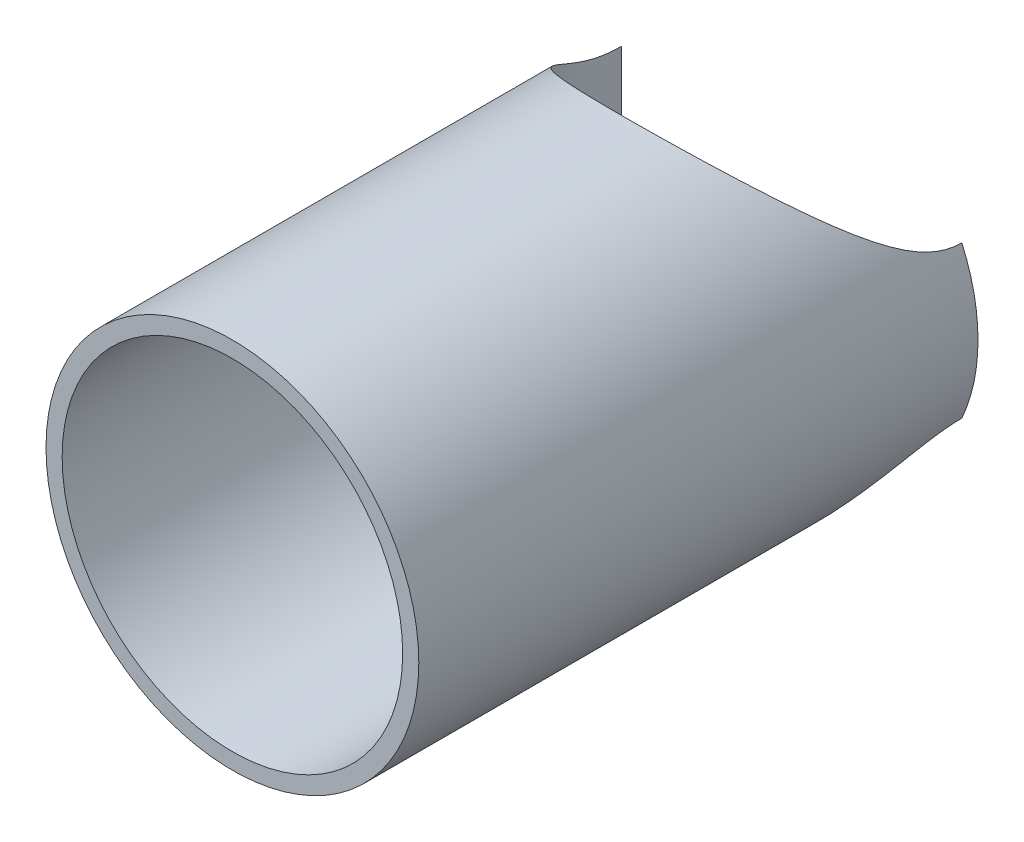
ISO-10303-21;
HEADER;
FILE_DESCRIPTION(('STEP AP214'),'2;1');
FILE_NAME('part.step','',(''),(''),'','','');
FILE_SCHEMA(('AUTOMOTIVE_DESIGN { 1 0 10303 214 1 1 1 1 }'));
ENDSEC;
DATA;
#1=APPLICATION_CONTEXT('core data for automotive mechanical design processes');
#2=APPLICATION_PROTOCOL_DEFINITION('international standard','automotive_design',2000,#1);
#3=PRODUCT_CONTEXT('',#1,'mechanical');
#4=PRODUCT('Part','Part','',(#3));
#5=PRODUCT_RELATED_PRODUCT_CATEGORY('part','',(#4));
#6=PRODUCT_DEFINITION_FORMATION('','',#4);
#7=PRODUCT_DEFINITION_CONTEXT('part definition',#1,'design');
#8=PRODUCT_DEFINITION('design','',#6,#7);
#9=PRODUCT_DEFINITION_SHAPE('','',#8);
#10=(LENGTH_UNIT() NAMED_UNIT(*) SI_UNIT(.MILLI.,.METRE.));
#11=(NAMED_UNIT(*) PLANE_ANGLE_UNIT() SI_UNIT($,.RADIAN.));
#12=(NAMED_UNIT(*) SI_UNIT($,.STERADIAN.) SOLID_ANGLE_UNIT());
#13=UNCERTAINTY_MEASURE_WITH_UNIT(LENGTH_MEASURE(1.E-05),#10,'distance_accuracy_value','');
#14=(GEOMETRIC_REPRESENTATION_CONTEXT(3) GLOBAL_UNCERTAINTY_ASSIGNED_CONTEXT((#13)) GLOBAL_UNIT_ASSIGNED_CONTEXT((#10,
#11,#12)) REPRESENTATION_CONTEXT('',''));
#15=CARTESIAN_POINT('',(0.,0.,0.));
#16=DIRECTION('',(0.,0.,1.));
#17=DIRECTION('',(1.,0.,0.));
#18=AXIS2_PLACEMENT_3D('',#15,#16,#17);
#19=CARTESIAN_POINT('',(0.,0.,0.));
#20=DIRECTION('',(0.,0.,1.));
#21=DIRECTION('',(1.,0.,0.));
#22=AXIS2_PLACEMENT_3D('',#19,#20,#21);
#23=CYLINDRICAL_SURFACE('',#22,17.399);
#24=CARTESIAN_POINT('',(0.,0.,57.15));
#25=DIRECTION('',(0.,0.,1.));
#26=DIRECTION('',(1.,0.,0.));
#27=AXIS2_PLACEMENT_3D('',#24,#25,#26);
#28=CIRCLE('',#27,17.399);
#29=CARTESIAN_POINT('',(17.399,0.,57.15));
#30=VERTEX_POINT('',#29);
#31=EDGE_CURVE('E63',#30,#30,#28,.T.);
#32=ORIENTED_EDGE('',*,*,#31,.T.);
#33=EDGE_LOOP('',(#32));
#34=FACE_BOUND('',#33,.T.);
#35=CARTESIAN_POINT('',(0.,0.,0.));
#36=DIRECTION('',(0.,0.707106781186547,0.707106781186547));
#37=DIRECTION('',(0.,-0.707106781186547,0.707106781186547));
#38=AXIS2_PLACEMENT_3D('',#35,#36,#37);
#39=ELLIPSE('',#38,24.6059017717295,17.399);
#40=CARTESIAN_POINT('',(17.399,0.,0.));
#41=VERTEX_POINT('',#40);
#42=CARTESIAN_POINT('',(-17.399,0.,0.));
#43=VERTEX_POINT('',#42);
#44=EDGE_CURVE('E66',#41,#43,#39,.F.);
#45=ORIENTED_EDGE('',*,*,#44,.T.);
#46=CARTESIAN_POINT('',(-17.399,0.,0.));
#47=CARTESIAN_POINT('',(-17.3990011308637,0.331328994913658,0.331288499369272));
#48=CARTESIAN_POINT('',(-17.3895359806133,0.662777773993524,0.662452537391861));
#49=CARTESIAN_POINT('',(-17.3541828902262,1.28061881246956,1.27984220901783));
#50=CARTESIAN_POINT('',(-17.3306707170862,1.56708522254114,1.56613126731348));
#51=CARTESIAN_POINT('',(-17.2741593932983,2.09467960281504,2.09380128423432));
#52=CARTESIAN_POINT('',(-17.2431973119173,2.33594824844743,2.33526043823023));
#53=CARTESIAN_POINT('',(-17.1776790099059,2.77346193365283,2.77318291899473));
#54=CARTESIAN_POINT('',(-17.1448260231368,2.96984141024758,2.96976916303656));
#55=CARTESIAN_POINT('',(-17.053195396441,3.46498957987095,3.46509972389225));
#56=CARTESIAN_POINT('',(-16.98985851291,3.76343285860517,3.76334049026127));
#57=CARTESIAN_POINT('',(-16.8511806994521,4.34120611378342,4.34086899698307));
#58=CARTESIAN_POINT('',(-16.7767389829828,4.62064871339775,4.62026081720835));
#59=CARTESIAN_POINT('',(-16.618357658026,5.16038592403,5.16002415026488));
#60=CARTESIAN_POINT('',(-16.5352733410015,5.42080962241243,5.42051715790507));
#61=CARTESIAN_POINT('',(-16.3619682824427,5.9225854699662,5.92246621840775));
#62=CARTESIAN_POINT('',(-16.2725596410971,6.16407928160144,6.16406139907093));
#63=CARTESIAN_POINT('',(-16.0648641936773,6.68870400423923,6.68872514664784));
#64=CARTESIAN_POINT('',(-15.9442842191765,6.97140000285117,6.97132558864669));
#65=CARTESIAN_POINT('',(-15.692090264551,7.52138357655295,7.52117234296158));
#66=CARTESIAN_POINT('',(-15.5611400425067,7.7888244237628,7.78856984279287));
#67=CARTESIAN_POINT('',(-15.2898825899193,8.30823658158246,8.30799045094507));
#68=CARTESIAN_POINT('',(-15.1502208515848,8.56037821331848,8.56017986480889));
#69=CARTESIAN_POINT('',(-14.8631475667476,9.04924098266211,9.04916207079481));
#70=CARTESIAN_POINT('',(-14.716363574788,9.28614688008941,9.28613845727461));
#71=CARTESIAN_POINT('',(-14.3951906833458,9.77740171343267,9.77741091638758));
#72=CARTESIAN_POINT('',(-14.2195041976432,10.0313338750929,10.0312781848761));
#73=CARTESIAN_POINT('',(-13.8583245878214,10.524357664459,10.5242054716175));
#74=CARTESIAN_POINT('',(-13.6733966582859,10.7636567269108,10.7634718304358));
#75=CARTESIAN_POINT('',(-13.2950314709039,11.2273598541476,11.2271796122021));
#76=CARTESIAN_POINT('',(-13.1021449124595,11.4519894946947,11.4518441165275));
#77=CARTESIAN_POINT('',(-12.7091177143155,11.8863833716026,11.8863260772742));
#78=CARTESIAN_POINT('',(-12.5095124093792,12.0963898718007,12.0963850678313));
#79=CARTESIAN_POINT('',(-12.0888476825434,12.5170535611354,12.5170585405004));
#80=CARTESIAN_POINT('',(-11.867271036784,12.7274545640097,12.7274132906681));
#81=CARTESIAN_POINT('',(-11.4161369932612,13.1334001596869,13.1332890696922));
#82=CARTESIAN_POINT('',(-11.1870452916996,13.3292035388693,13.3290682211509));
#83=CARTESIAN_POINT('',(-10.7219396261346,13.7059083660326,13.7057759704559));
#84=CARTESIAN_POINT('',(-10.4863707163118,13.8870849012415,13.8869780619076));
#85=CARTESIAN_POINT('',(-10.0093409437893,14.2345561896179,14.2345143840518));
#86=CARTESIAN_POINT('',(-9.76830223262916,14.4011404127409,14.4011376187175));
#87=CARTESIAN_POINT('',(-9.27469282491392,14.7238513521684,14.7238541327518));
#88=CARTESIAN_POINT('',(-9.02218317762893,14.8800245173527,14.8799942085943));
#89=CARTESIAN_POINT('',(-8.51143320550011,15.17780577695,15.1777255632559));
#90=CARTESIAN_POINT('',(-8.25351231100356,15.3196868999698,15.3195894701364));
#91=CARTESIAN_POINT('',(-7.86055793692457,15.522822723787,15.5227259132659));
#92=CARTESIAN_POINT('',(-7.72987393547371,15.5883224924115,15.5882301268393));
#93=CARTESIAN_POINT('',(-7.46744079934224,15.7157097134347,15.7156329083403));
#94=CARTESIAN_POINT('',(-7.33572578439618,15.7776322605029,15.7775664862578));
#95=CARTESIAN_POINT('',(-7.0713408526649,15.89786675948,15.8978253102093));
#96=CARTESIAN_POINT('',(-6.93870294731716,15.9562139212813,15.9561857364243));
#97=CARTESIAN_POINT('',(-6.67257484172981,16.0693059665347,16.0692983003262));
#98=CARTESIAN_POINT('',(-6.5391145696896,16.124086000282,16.1240856593634));
#99=CARTESIAN_POINT('',(-6.27314212663758,16.2293820508048,16.2293823833748));
#100=CARTESIAN_POINT('',(-6.14068677200883,16.2799696359967,16.2799636546496));
#101=CARTESIAN_POINT('',(-5.8748684496391,16.3777589819801,16.3777371159858));
#102=CARTESIAN_POINT('',(-5.74152553126073,16.4249879659121,16.4249565601746));
#103=CARTESIAN_POINT('',(-5.47402115877983,16.5160550971116,16.5160062636609));
#104=CARTESIAN_POINT('',(-5.33987788890363,16.5599199494832,16.5598632139616));
#105=CARTESIAN_POINT('',(-5.0708615482511,16.6442561413558,16.6441886913204));
#106=CARTESIAN_POINT('',(-4.93600480608221,16.6847535344294,16.6846832285512));
#107=CARTESIAN_POINT('',(-4.66564969995905,16.7623545036231,16.762284561608));
#108=CARTESIAN_POINT('',(-4.53016583341798,16.7994833464645,16.7994165741733));
#109=CARTESIAN_POINT('',(-4.25864402464156,16.8703492415508,16.8702936771996));
#110=CARTESIAN_POINT('',(-4.1226187875179,16.9041106384636,16.9040630739031));
#111=CARTESIAN_POINT('',(-3.85010126264908,16.9682459387044,16.9682159832133));
#112=CARTESIAN_POINT('',(-3.7136199403314,16.9986431310521,16.9986227724491));
#113=CARTESIAN_POINT('',(-3.44027598403682,17.0560566629996,17.0560512035975));
#114=CARTESIAN_POINT('',(-3.30342264906392,17.0830951044979,17.0830949768953));
#115=CARTESIAN_POINT('',(-3.03546364409865,17.1326815825355,17.132681703699));
#116=CARTESIAN_POINT('',(-2.90441642762355,17.1553873643714,17.1553829144864));
#117=CARTESIAN_POINT('',(-2.64192370290757,17.1977626436417,17.1977466393632));
#118=CARTESIAN_POINT('',(-2.51048219796085,17.2174445285761,17.2174215511955));
#119=CARTESIAN_POINT('',(-2.24727207444598,17.2537692378582,17.2537335254227));
#120=CARTESIAN_POINT('',(-2.11550651579715,17.2704231484942,17.2703816696755));
#121=CARTESIAN_POINT('',(-1.85171901959868,17.3006908882117,17.3006415630633));
#122=CARTESIAN_POINT('',(-1.71969931056298,17.3143144308917,17.3142630138654));
#123=CARTESIAN_POINT('',(-1.45547409463277,17.3385220761164,17.3384708920411));
#124=CARTESIAN_POINT('',(-1.323270104293,17.3491144575098,17.3490655860987));
#125=CARTESIAN_POINT('',(-1.05874661674972,17.3672620877226,17.36722140925));
#126=CARTESIAN_POINT('',(-0.926428051590948,17.3748241285407,17.3747893222893));
#127=CARTESIAN_POINT('',(-0.661745401360201,17.3869150272733,17.3868930938386));
#128=CARTESIAN_POINT('',(-0.529381797623768,17.3914491490759,17.3914342142522));
#129=CARTESIAN_POINT('',(-0.264678682179303,17.3974897824417,17.3974858865217));
#130=CARTESIAN_POINT('',(-0.13233933998178,17.3989999999915,17.3990001479815));
#131=CARTESIAN_POINT('',(0.132343102844987,17.3990000000085,17.3989998520142));
#132=CARTESIAN_POINT('',(0.264686203474104,17.3974896965932,17.3974852084662));
#133=CARTESIAN_POINT('',(0.529395756251864,17.3914487446318,17.3914329206721));
#134=CARTESIAN_POINT('',(0.661762040001853,17.3869144144388,17.3868915915467));
#135=CARTESIAN_POINT('',(0.92644896772938,17.3748230255675,17.3747874520819));
#136=CARTESIAN_POINT('',(1.0587691326032,17.3672607273787,17.3672194044208));
#137=CARTESIAN_POINT('',(1.32329473756529,17.3491125827395,17.3490633877189));
#138=CARTESIAN_POINT('',(1.4554992489517,17.3385199686424,17.3384686592246));
#139=CARTESIAN_POINT('',(1.71972442920772,17.3143119319016,17.3142607827641));
#140=CARTESIAN_POINT('',(1.85174358595603,17.3006882546736,17.300639392332));
#141=CARTESIAN_POINT('',(2.11552890590344,17.2704203934741,17.270379685527));
#142=CARTESIAN_POINT('',(2.24729284607558,17.2537665200233,17.2537316913085));
#143=CARTESIAN_POINT('',(2.51049867631982,17.2174421050912,17.2174201090593));
#144=CARTESIAN_POINT('',(2.64193751299076,17.1977605012373,17.1977454625961));
#145=CARTESIAN_POINT('',(2.90442384157753,17.1553860801165,17.1553822628499));
#146=CARTESIAN_POINT('',(3.03546733761075,17.1326808990283,17.1326813342488));
#147=CARTESIAN_POINT('',(3.30342657291425,17.0830943783941,17.0830939200179));
#148=CARTESIAN_POINT('',(3.44028379405071,17.0560551202761,17.0560490037316));
#149=CARTESIAN_POINT('',(3.71363437804045,16.9986400001387,16.9986186527062));
#150=CARTESIAN_POINT('',(3.85011845296442,16.9682420615591,16.9682111142236));
#151=CARTESIAN_POINT('',(4.12264033144995,16.904105398461,16.9040569697761));
#152=CARTESIAN_POINT('',(4.25866718163659,16.870343410098,16.8702871133423));
#153=CARTESIAN_POINT('',(4.53019108564152,16.7994765416222,16.7994093825609));
#154=CARTESIAN_POINT('',(4.66567544748057,16.76234734177,16.7622772275004));
#155=CARTESIAN_POINT('',(4.9360304323311,16.6847459483422,16.6846758961775));
#156=CARTESIAN_POINT('',(5.0708865720189,16.6442485126905,16.6441815277317));
#157=CARTESIAN_POINT('',(5.33990061783175,16.55991260583,16.5598566711235));
#158=CARTESIAN_POINT('',(5.47404221030653,16.5160481053818,16.5160001963081));
#159=CARTESIAN_POINT('',(5.74154217437029,16.4249821235549,16.4249517522341));
#160=CARTESIAN_POINT('',(5.87488237757024,16.3777539610281,16.377733114662));
#161=CARTESIAN_POINT('',(6.14069421589947,16.2799667936959,16.2799614823963));
#162=CARTESIAN_POINT('',(6.27314581793012,16.2293805894571,16.2293812542933));
#163=CARTESIAN_POINT('',(6.53911843369672,16.1240844705558,16.1240837889914));
#164=CARTESIAN_POINT('',(6.6725825007365,16.0693028234905,16.0692944809927));
#165=CARTESIAN_POINT('',(6.93871704145251,15.9562078188688,15.956178611685));
#166=CARTESIAN_POINT('',(7.07135760783225,15.8978593336773,15.8978168557831));
#167=CARTESIAN_POINT('',(7.33574670377706,15.7776225505781,15.7775558713312));
#168=CARTESIAN_POINT('',(7.46746324313444,15.7156990653493,15.7156214868573));
#169=CARTESIAN_POINT('',(7.72989830986156,15.5883104113434,15.5882176122188));
#170=CARTESIAN_POINT('',(7.86058273950878,15.5228101701612,15.5227131352272));
#171=CARTESIAN_POINT('',(8.25353521535424,15.3196745134129,15.3195775255319));
#172=CARTESIAN_POINT('',(8.51145389332373,15.177794126177,15.1777148432391));
#173=CARTESIAN_POINT('',(9.02219526517278,14.8800170481196,14.8799876943916));
#174=CARTESIAN_POINT('',(9.27469871505861,14.7238475016823,14.7238507467716));
#175=CARTESIAN_POINT('',(9.76830834571355,14.4011364157789,14.4011331548459));
#176=CARTESIAN_POINT('',(10.0093528614838,14.2345479589407,14.2345052423058));
#177=CARTESIAN_POINT('',(10.4863899241457,13.8870704451552,13.8869626730327));
#178=CARTESIAN_POINT('',(10.7219605410667,13.7058920566566,13.7057591792237));
#179=CARTESIAN_POINT('',(11.1870656131564,13.3291864289314,13.3290515004162));
#180=CARTESIAN_POINT('',(11.4161552377849,13.1333842417648,13.1332739587925));
#181=CARTESIAN_POINT('',(11.8672815432061,12.7274445947568,12.7274041499341));
#182=CARTESIAN_POINT('',(12.088852755031,12.5170484889207,12.517053873492));
#183=CARTESIAN_POINT('',(12.5095175578729,12.0963847230684,12.0963795279133));
#184=CARTESIAN_POINT('',(12.7091276713605,11.8863729021756,11.8863148376935));
#185=CARTESIAN_POINT('',(13.1021607290177,11.4519714571547,11.4518252711373));
#186=CARTESIAN_POINT('',(13.2950485751887,11.2273396628897,11.2271589823143));
#187=CARTESIAN_POINT('',(13.6734130173025,10.7636358783721,10.763451251504));
#188=CARTESIAN_POINT('',(13.858339153512,10.524338411798,10.5241868247927));
#189=CARTESIAN_POINT('',(14.2195124215554,10.031321996054,10.0312669453136));
#190=CARTESIAN_POINT('',(14.3951946051437,9.7773957150844,9.77740523066256));
#191=CARTESIAN_POINT('',(14.7163674472392,9.28614095665167,9.28613224729147));
#192=CARTESIAN_POINT('',(14.8631549792588,9.04922902525791,9.04914954618527));
#193=CARTESIAN_POINT('',(15.1502323847489,8.56035787657117,8.56015891678717));
#194=CARTESIAN_POINT('',(15.2898949291603,8.30821395404564,8.3079674730765));
#195=CARTESIAN_POINT('',(15.5611515555253,7.78880133314123,7.78854689744975));
#196=CARTESIAN_POINT('',(15.6921003797321,7.52136237689545,7.52115152000875));
#197=CARTESIAN_POINT('',(15.944289741381,6.97138706353182,6.97131306349413));
#198=CARTESIAN_POINT('',(16.0648667682493,6.68869750139016,6.68871884448677));
#199=CARTESIAN_POINT('',(16.2725620824778,6.16407311454511,6.16405506139386));
#200=CARTESIAN_POINT('',(16.3619728725739,5.92257307722494,5.92245348547243));
#201=CARTESIAN_POINT('',(16.535280221155,5.42078874277266,5.42049589512133));
#202=CARTESIAN_POINT('',(16.618364872423,5.16036280687721,5.16000079710574));
#203=CARTESIAN_POINT('',(16.7767453827511,4.62062534005807,4.62023748154183));
#204=CARTESIAN_POINT('',(16.8511861632785,4.34118475559803,4.34084779902526));
#205=CARTESIAN_POINT('',(16.9898612578486,3.76341993156685,3.7633277559053));
#206=CARTESIAN_POINT('',(17.053196594646,3.464983105639,3.46509333680204));
#207=CARTESIAN_POINT('',(17.1448268330524,2.96983703330779,2.96976472575839));
#208=CARTESIAN_POINT('',(17.1776804769336,2.77345316738225,2.7731740281345));
#209=CARTESIAN_POINT('',(17.2431993186325,2.33593358655074,2.33524560548374));
#210=CARTESIAN_POINT('',(17.2741613748475,2.09466343246891,2.09378498081143));
#211=CARTESIAN_POINT('',(17.3306721606797,1.567068988297,1.56611497024853));
#212=CARTESIAN_POINT('',(17.3541839563502,1.28060403473809,1.27982739369487));
#213=CARTESIAN_POINT('',(17.3895362343148,0.66276888754068,0.662443645442081));
#214=CARTESIAN_POINT('',(17.3990011304629,0.331324551349306,0.331284053321532));
#215=CARTESIAN_POINT('',(17.399,0.,0.));
#216=B_SPLINE_CURVE_WITH_KNOTS('',3,(#46,#47,#48,#49,#50,#51,#52,#53,#54,#55,#56,#57,#58,#59,
#60,#61,#62,#63,#64,#65,#66,#67,#68,#69,#70,#71,#72,#73,#74,#75,#76,#77,#78,#79,#80,#81,#82,#83,
#84,#85,#86,#87,#88,#89,#90,#91,#92,#93,#94,#95,#96,#97,#98,#99,#100,#101,#102,#103,#104,#105,
#106,#107,#108,#109,#110,#111,#112,#113,#114,#115,#116,#117,#118,#119,#120,#121,#122,#123,#124,
#125,#126,#127,#128,#129,#130,#131,#132,#133,#134,#135,#136,#137,#138,#139,#140,#141,#142,#143,
#144,#145,#146,#147,#148,#149,#150,#151,#152,#153,#154,#155,#156,#157,#158,#159,#160,#161,#162,
#163,#164,#165,#166,#167,#168,#169,#170,#171,#172,#173,#174,#175,#176,#177,#178,#179,#180,#181,
#182,#183,#184,#185,#186,#187,#188,#189,#190,#191,#192,#193,#194,#195,#196,#197,#198,#199,#200,
#201,#202,#203,#204,#205,#206,#207,#208,#209,#210,#211,#212,#213,#214,#215),.UNSPECIFIED.,.F.,
.F.,(4,2,2,2,2,2,2,2,2,2,2,2,2,2,2,2,2,2,2,2,2,2,2,2,2,2,2,2,2,2,2,2,2,2,2,2,2,2,2,2,2,2,2,2,2,
2,2,2,2,2,2,2,2,2,2,2,2,2,2,2,2,2,2,2,2,2,2,2,2,2,2,2,2,2,2,2,2,2,2,2,2,2,2,2,4),(0.,
1.40551630396895,2.62231117885233,3.65037899448081,4.48971758438184,5.76932583809445,
6.9753849332022,8.10794438794428,9.16706431128378,10.4192554462773,11.6195891287589,
12.7682494574323,13.8654466039762,15.0642686263511,16.2207668838282,17.3353827550133,
18.4086093128293,19.521019988392,20.5986721998633,21.6423941807822,22.6530975875911,
23.6589392392227,24.6386430781611,25.1191397415278,25.5935874776259,26.0621612660575,
26.5250427479471,26.9765889886385,27.423915460162,27.867213682969,28.3066804441005,
28.7425177205185,29.1749325751135,29.6041370240872,30.0303478746664,30.4350509025217,
30.8380491089705,31.239540728672,31.6397262351866,32.0388080704063,32.4369903595961,
32.8344786138765,33.23147942219,33.6284915186038,34.0259878478789,34.42417498677,
34.8232584392862,35.2234423286034,35.6249290994545,36.0279192330441,36.4326109763195,
36.8588341719642,37.2880474518629,37.720467610057,38.1563066551372,38.5957716476569,
39.0390645671939,39.486382208024,39.9379161021075,40.4008112215822,40.8693947623903,
41.3438483542563,41.8243469702461,42.8040430011724,43.8098612581141,44.8205903103499,
45.8643208478344,46.9419645023942,48.0543495253715,49.1276035107911,50.2422285290847,
51.3987176391151,52.5975122283296,53.6947376105801,54.8434073531731,56.043731621553,
57.2958945179331,58.3550419584849,59.487610586171,60.6936605083512,61.9732412444898,
62.8125986887249,63.8406727889923,65.0574613794757,66.4629588311663),.UNSPECIFIED.);
#217=EDGE_CURVE('E55',#43,#41,#216,.T.);
#218=ORIENTED_EDGE('',*,*,#217,.T.);
#219=EDGE_LOOP('',(#45,#218));
#220=FACE_BOUND('',#219,.T.);
#221=ADVANCED_FACE('F16',(#34,#220),#23,.F.);
#222=CARTESIAN_POINT('',(0.,0.,57.15));
#223=DIRECTION('',(0.,0.,-1.));
#224=DIRECTION('',(-1.,0.,0.));
#225=AXIS2_PLACEMENT_3D('',#222,#223,#224);
#226=PLANE('',#225);
#227=ORIENTED_EDGE('',*,*,#31,.F.);
#228=EDGE_LOOP('',(#227));
#229=FACE_BOUND('',#228,.T.);
#230=CARTESIAN_POINT('',(0.,0.,57.15));
#231=DIRECTION('',(0.,0.,1.));
#232=DIRECTION('',(1.,0.,0.));
#233=AXIS2_PLACEMENT_3D('',#230,#231,#232);
#234=CIRCLE('',#233,19.05);
#235=CARTESIAN_POINT('',(19.05,0.,57.15));
#236=VERTEX_POINT('',#235);
#237=EDGE_CURVE('E86',#236,#236,#234,.F.);
#238=ORIENTED_EDGE('',*,*,#237,.F.);
#239=EDGE_LOOP('',(#238));
#240=FACE_BOUND('',#239,.T.);
#241=ADVANCED_FACE('F122',(#229,#240),#226,.F.);
#242=CARTESIAN_POINT('',(0.,0.,0.));
#243=DIRECTION('',(0.,1.,0.));
#244=DIRECTION('',(0.,0.,1.));
#245=AXIS2_PLACEMENT_3D('',#242,#243,#244);
#246=CYLINDRICAL_SURFACE('',#245,17.399);
#247=ORIENTED_EDGE('',*,*,#217,.F.);
#248=DIRECTION('',(0.,1.,0.));
#249=VECTOR('',#248,1.);
#250=CARTESIAN_POINT('',(-17.399,0.,0.));
#251=LINE('',#250,#249);
#252=CARTESIAN_POINT('',(-17.399,7.75740285147033,0.));
#253=VERTEX_POINT('',#252);
#254=EDGE_CURVE('E60',#253,#43,#251,.F.);
#255=ORIENTED_EDGE('',*,*,#254,.F.);
#256=CARTESIAN_POINT('',(17.399,7.75740285147032,0.));
#257=CARTESIAN_POINT('',(17.3990027926557,7.75738928067626,0.126619411653411));
#258=CARTESIAN_POINT('',(17.3976172953479,7.76050481767002,0.25321342214225));
#259=CARTESIAN_POINT('',(17.3920993093259,7.7728663106787,0.506011561056936));
#260=CARTESIAN_POINT('',(17.3879674951789,7.78211076127069,0.632215777580589));
#261=CARTESIAN_POINT('',(17.3715310393773,7.81876986710136,1.00902330778525));
#262=CARTESIAN_POINT('',(17.3551849725285,7.85511193712096,1.25863541656879));
#263=CARTESIAN_POINT('',(17.3126787054344,7.94834436267528,1.74803233786395));
#264=CARTESIAN_POINT('',(17.2867118539878,8.00482912325347,1.98791378893045));
#265=CARTESIAN_POINT('',(17.2256220476168,8.13545614886296,2.46176178605719));
#266=CARTESIAN_POINT('',(17.1904915826852,8.20961289257842,2.69572330712606));
#267=CARTESIAN_POINT('',(17.0914704002142,8.41444164911149,3.27608545997221));
#268=CARTESIAN_POINT('',(17.0220928683165,8.55453145327276,3.6182148201961));
#269=CARTESIAN_POINT('',(16.8659507450822,8.85840913920196,4.2875618159471));
#270=CARTESIAN_POINT('',(16.7791763237468,9.02221040436538,4.6147708919803));
#271=CARTESIAN_POINT('',(16.5885907607409,9.36806215757178,5.25908025866418));
#272=CARTESIAN_POINT('',(16.4846028375362,9.55029344833314,5.57602990071133));
#273=CARTESIAN_POINT('',(16.2611162606568,9.92604811707565,6.19761374754541));
#274=CARTESIAN_POINT('',(16.1416117153161,10.1195757688457,6.50224321644266));
#275=CARTESIAN_POINT('',(15.9012328343761,10.4927199440383,7.0682446326165));
#276=CARTESIAN_POINT('',(15.7818795075659,10.6716028930283,7.33075234639334));
#277=CARTESIAN_POINT('',(15.531375280231,11.0330066315397,7.84755054304734));
#278=CARTESIAN_POINT('',(15.4002228366692,11.2155278944272,8.10183994524194));
#279=CARTESIAN_POINT('',(15.1261173325553,11.5825543909568,8.60275103720113));
#280=CARTESIAN_POINT('',(14.9831580377589,11.7670606274058,8.84936858024162));
#281=CARTESIAN_POINT('',(14.6854749405307,12.1365419716062,9.33504840785215));
#282=CARTESIAN_POINT('',(14.5307500246226,12.3215171221294,9.57410997430043));
#283=CARTESIAN_POINT('',(14.0499414824725,12.873976753931,10.2784757466186));
#284=CARTESIAN_POINT('',(13.706221982577,13.2403569500405,10.7327911450247));
#285=CARTESIAN_POINT('',(12.9709988366539,13.9614056628348,11.6105902831832));
#286=CARTESIAN_POINT('',(12.5795204493307,14.3160802453506,12.0340901330639));
#287=CARTESIAN_POINT('',(11.8513027830295,14.9202493412787,12.7460780346227));
#288=CARTESIAN_POINT('',(11.5252152004648,15.17393857843,13.0419213680792));
#289=CARTESIAN_POINT('',(10.8451357651757,15.6672254345686,13.6126880208168));
#290=CARTESIAN_POINT('',(10.4911442114866,15.9068232045201,13.8876115642246));
#291=CARTESIAN_POINT('',(9.75564643242529,16.3682053590736,14.4137713143204));
#292=CARTESIAN_POINT('',(9.37416774185506,16.5900071123435,14.6650306596365));
#293=CARTESIAN_POINT('',(8.58390774378863,17.0123369264844,15.1411487148883));
#294=CARTESIAN_POINT('',(8.17513251731962,17.2128696999897,15.3660132743823));
#295=CARTESIAN_POINT('',(7.41609675759785,17.5510787980119,15.7438449488538));
#296=CARTESIAN_POINT('',(7.07052907343836,17.6932976749746,15.9021892450144));
#297=CARTESIAN_POINT('',(6.36382451687043,17.9595864108884,16.1979501260028));
#298=CARTESIAN_POINT('',(6.00269106933712,18.0836602360993,16.3353712846128));
#299=CARTESIAN_POINT('',(5.26647789377182,18.3116118596446,16.5873660705376));
#300=CARTESIAN_POINT('',(4.89140366751785,18.4154975265765,16.7019485999545));
#301=CARTESIAN_POINT('',(4.12923028647434,18.6012306252741,16.9065171053999));
#302=CARTESIAN_POINT('',(3.74213100127713,18.6830778179467,16.9965028145804));
#303=CARTESIAN_POINT('',(2.95593537190506,18.8235337773239,17.1507769807365));
#304=CARTESIAN_POINT('',(2.55677683000922,18.8819860313285,17.2148923872178));
#305=CARTESIAN_POINT('',(1.75207798329656,18.9735785556383,17.3153056168189));
#306=CARTESIAN_POINT('',(1.34653766138734,19.0067187581382,17.3516033654214));
#307=CARTESIAN_POINT('',(0.532740871466215,19.0469054092445,17.3956140232931));
#308=CARTESIAN_POINT('',(0.124485289769621,19.0539599906146,17.4033358417348));
#309=CARTESIAN_POINT('',(-0.691145635542919,19.0418258138202,17.3900500247943));
#310=CARTESIAN_POINT('',(-1.09852104488593,19.02263908821,17.3690446145166));
#311=CARTESIAN_POINT('',(-1.8665074066449,18.9618364386318,17.3024305274246));
#312=CARTESIAN_POINT('',(-2.22756908470296,18.9227652631555,17.2596128163397));
#313=CARTESIAN_POINT('',(-2.94361664813323,18.8246695916722,17.1520079260685));
#314=CARTESIAN_POINT('',(-3.29860304440391,18.7656467822389,17.0872226038712));
#315=CARTESIAN_POINT('',(-4.0003834177903,18.6286682489913,16.9366748894927));
#316=CARTESIAN_POINT('',(-4.34717668373009,18.5507108882069,16.8509106835957));
#317=CARTESIAN_POINT('',(-5.03073264287061,18.3771216594109,16.65961931318));
#318=CARTESIAN_POINT('',(-5.36749474073485,18.2814887447958,16.5540909783843));
#319=CARTESIAN_POINT('',(-6.0450883689476,18.0690712727941,16.319211609248));
#320=CARTESIAN_POINT('',(-6.38536566225004,17.9515031398445,16.1889732182396));
#321=CARTESIAN_POINT('',(-7.05200979717746,17.7002421296737,15.9099012910429));
#322=CARTESIAN_POINT('',(-7.37837661185776,17.5665492212207,15.7610677188377));
#323=CARTESIAN_POINT('',(-8.01637955747606,17.2847274052077,15.4463398391999));
#324=CARTESIAN_POINT('',(-8.328012631591,17.1365955213283,15.2804420139058));
#325=CARTESIAN_POINT('',(-8.935938653738,16.8275912941987,14.9330779736276));
#326=CARTESIAN_POINT('',(-9.23222831724048,16.6667162415391,14.751608447154));
#327=CARTESIAN_POINT('',(-9.9610807011477,16.24616265681,14.2751141336036));
#328=CARTESIAN_POINT('',(-10.3832304302347,15.9790705087056,13.9706188807904));
#329=CARTESIAN_POINT('',(-11.1906483352997,15.4243967388524,13.3326512383542));
#330=CARTESIAN_POINT('',(-11.5758996118658,15.1368058328948,12.9991657033674));
#331=CARTESIAN_POINT('',(-12.3107246973626,14.5454983316236,12.3055766392129));
#332=CARTESIAN_POINT('',(-12.6601983724747,14.2417399093146,11.9454030182208));
#333=CARTESIAN_POINT('',(-13.3228256699069,13.6238744147983,11.2015895641249));
#334=CARTESIAN_POINT('',(-13.6359864105728,13.3097693863682,10.8179543527437));
#335=CARTESIAN_POINT('',(-14.2338486111263,12.6687294700676,10.0188698517803));
#336=CARTESIAN_POINT('',(-14.517686463156,12.3416676006416,9.60287793519721));
#337=CARTESIAN_POINT('',(-15.0487827113267,11.688186754623,8.74718214020965));
#338=CARTESIAN_POINT('',(-15.2960234328361,11.3617681633013,8.30746694358541));
#339=CARTESIAN_POINT('',(-15.6391176739874,10.8793160856903,7.62936065904868));
#340=CARTESIAN_POINT('',(-15.7488029782036,10.719778727444,7.40036468575159));
#341=CARTESIAN_POINT('',(-15.9589029321097,10.4044108647402,6.93568044188579));
#342=CARTESIAN_POINT('',(-16.0593187405627,10.2485798987662,6.69999301263361));
#343=CARTESIAN_POINT('',(-16.25064002581,9.94242216980458,6.22159236078593));
#344=CARTESIAN_POINT('',(-16.3415534376162,9.79209088359618,5.9788852198135));
#345=CARTESIAN_POINT('',(-16.5136633013956,9.49896230357114,5.48564865833395));
#346=CARTESIAN_POINT('',(-16.5948621460068,9.35616315949889,5.23512118317326));
#347=CARTESIAN_POINT('',(-16.7399044598348,9.0938654480011,4.74960595279279));
#348=CARTESIAN_POINT('',(-16.8046633839798,8.97344114073015,4.51539494834857));
#349=CARTESIAN_POINT('',(-16.9253972886873,8.74358476749362,4.03935876063696));
#350=CARTESIAN_POINT('',(-16.981371807116,8.63415327995198,3.79753317758154));
#351=CARTESIAN_POINT('',(-17.0835577011958,8.43015385639926,3.30749209621929));
#352=CARTESIAN_POINT('',(-17.1298288043977,8.33549596631582,3.05932691299979));
#353=CARTESIAN_POINT('',(-17.2122316312634,8.16398538994439,2.5552691644349));
#354=CARTESIAN_POINT('',(-17.2483680118588,8.08712452871587,2.29938020825192));
#355=CARTESIAN_POINT('',(-17.2984619179858,7.97921413520514,1.87510757973661));
#356=CARTESIAN_POINT('',(-17.3157056836072,7.94167042397934,1.70875077851932));
#357=CARTESIAN_POINT('',(-17.3454986249528,7.87638621901043,1.37373521286451));
#358=CARTESIAN_POINT('',(-17.35804919276,7.84864281846194,1.20507714643116));
#359=CARTESIAN_POINT('',(-17.3783689967595,7.80355358549084,0.864236195915917));
#360=CARTESIAN_POINT('',(-17.386085725966,7.78632198711612,0.692034904492624));
#361=CARTESIAN_POINT('',(-17.3964114605965,7.76320820627028,0.346566926126348));
#362=CARTESIAN_POINT('',(-17.3990157927525,7.75733640792047,0.173299409508219));
#363=CARTESIAN_POINT('',(-17.399,7.75740285147036,0.));
#364=B_SPLINE_CURVE_WITH_KNOTS('',3,(#256,#257,#258,#259,#260,#261,#262,#263,#264,#265,#266,
#267,#268,#269,#270,#271,#272,#273,#274,#275,#276,#277,#278,#279,#280,#281,#282,#283,#284,#285,
#286,#287,#288,#289,#290,#291,#292,#293,#294,#295,#296,#297,#298,#299,#300,#301,#302,#303,#304,
#305,#306,#307,#308,#309,#310,#311,#312,#313,#314,#315,#316,#317,#318,#319,#320,#321,#322,#323,
#324,#325,#326,#327,#328,#329,#330,#331,#332,#333,#334,#335,#336,#337,#338,#339,#340,#341,#342,
#343,#344,#345,#346,#347,#348,#349,#350,#351,#352,#353,#354,#355,#356,#357,#358,#359,#360,#361,
#362,#363),.UNSPECIFIED.,.F.,.F.,(4,2,2,2,2,2,2,2,2,2,2,2,2,2,2,2,2,2,2,2,2,2,2,2,2,2,2,2,2,2,2,
2,2,2,2,2,2,2,2,2,2,2,2,2,2,2,2,2,2,2,2,2,2,4),(0.,0.379764092853832,0.759434940165907,
1.51634726991587,2.25880724087371,3.00187761458815,4.12835037763911,5.25546144985719,
6.39496160348711,7.53489569789875,8.55259337985784,9.57042434587642,10.5887962249633,
11.6072646010801,13.6367495933949,15.6651658480776,17.1883664070907,18.71155064481,
20.2332297195439,21.754570923617,22.9709961355442,24.187155054878,25.4028390055058,
26.6185361444175,27.8422355786928,29.0659382909752,30.2892594549617,31.5124858703965,
32.6082843336791,33.7039901888642,34.7997908060849,35.8956563285599,37.043090764153,
38.1905274222329,39.3382011047018,40.4861194600479,42.2386035757021,43.991886525206,
45.749949583538,47.5076674278728,49.3075787665061,51.1083565581975,52.0077767250255,
52.9070843042517,53.8056348105302,54.7039635517725,55.5171752742101,56.3304297641097,
57.1385211097759,57.9462405247014,58.4601584642904,58.9739238458356,59.4931773421598,
60.0129052701035),.UNSPECIFIED.);
#365=CARTESIAN_POINT('',(17.399,7.75740285147032,0.));
#366=VERTEX_POINT('',#365);
#367=EDGE_CURVE('E49',#366,#253,#364,.T.);
#368=ORIENTED_EDGE('',*,*,#367,.F.);
#369=DIRECTION('',(0.,1.,0.));
#370=VECTOR('',#369,1.);
#371=CARTESIAN_POINT('',(17.399,0.,0.));
#372=LINE('',#371,#370);
#373=EDGE_CURVE('E62',#41,#366,#372,.T.);
#374=ORIENTED_EDGE('',*,*,#373,.F.);
#375=EDGE_LOOP('',(#247,#255,#368,#374));
#376=FACE_BOUND('',#375,.T.);
#377=ADVANCED_FACE('F58',(#376),#246,.F.);
#378=CARTESIAN_POINT('',(0.,0.,0.));
#379=DIRECTION('',(0.,0.,-1.));
#380=DIRECTION('',(-1.,0.,0.));
#381=AXIS2_PLACEMENT_3D('',#378,#379,#380);
#382=PLANE('',#381);
#383=DIRECTION('',(0.,1.,0.));
#384=VECTOR('',#383,1.);
#385=CARTESIAN_POINT('',(-17.399,0.,0.));
#386=LINE('',#385,#384);
#387=CARTESIAN_POINT('',(-17.399,-7.75740285147033,0.));
#388=VERTEX_POINT('',#387);
#389=EDGE_CURVE('E68',#43,#388,#386,.F.);
#390=ORIENTED_EDGE('',*,*,#389,.T.);
#391=CARTESIAN_POINT('',(0.,0.,0.));
#392=DIRECTION('',(0.,0.,1.));
#393=DIRECTION('',(1.,0.,0.));
#394=AXIS2_PLACEMENT_3D('',#391,#392,#393);
#395=CIRCLE('',#394,19.05);
#396=EDGE_CURVE('E72',#253,#388,#395,.T.);
#397=ORIENTED_EDGE('',*,*,#396,.F.);
#398=ORIENTED_EDGE('',*,*,#254,.T.);
#399=EDGE_LOOP('',(#390,#397,#398));
#400=FACE_BOUND('',#399,.T.);
#401=ADVANCED_FACE('F70',(#400),#382,.T.);
#402=CARTESIAN_POINT('',(0.,0.,0.));
#403=DIRECTION('',(0.,1.,0.));
#404=DIRECTION('',(0.,0.,1.));
#405=AXIS2_PLACEMENT_3D('',#402,#403,#404);
#406=CYLINDRICAL_SURFACE('',#405,17.399);
#407=ORIENTED_EDGE('',*,*,#389,.F.);
#408=ORIENTED_EDGE('',*,*,#44,.F.);
#409=DIRECTION('',(0.,1.,0.));
#410=VECTOR('',#409,1.);
#411=CARTESIAN_POINT('',(17.399,0.,0.));
#412=LINE('',#411,#410);
#413=CARTESIAN_POINT('',(17.399,-7.75740285147033,0.));
#414=VERTEX_POINT('',#413);
#415=EDGE_CURVE('E35',#414,#41,#412,.T.);
#416=ORIENTED_EDGE('',*,*,#415,.F.);
#417=CARTESIAN_POINT('',(-17.399,-7.75740285147033,0.));
#418=CARTESIAN_POINT('',(-17.3990027926557,-7.75738928067626,0.12661941165341));
#419=CARTESIAN_POINT('',(-17.3976172953479,-7.76050481767003,0.253213422142249));
#420=CARTESIAN_POINT('',(-17.3920993093259,-7.77286631067871,0.506011561056935));
#421=CARTESIAN_POINT('',(-17.3879674951789,-7.78211076127069,0.632215777580588));
#422=CARTESIAN_POINT('',(-17.3715310393773,-7.81876986710136,1.00902330778525));
#423=CARTESIAN_POINT('',(-17.3551849725285,-7.85511193712095,1.25863541656879));
#424=CARTESIAN_POINT('',(-17.3126787054344,-7.94834436267528,1.74803233786395));
#425=CARTESIAN_POINT('',(-17.2867118539878,-8.00482912325347,1.98791378893045));
#426=CARTESIAN_POINT('',(-17.2256220476168,-8.13545614886296,2.46176178605719));
#427=CARTESIAN_POINT('',(-17.1904915826852,-8.20961289257843,2.69572330712606));
#428=CARTESIAN_POINT('',(-17.0914704002142,-8.4144416491115,3.27608545997221));
#429=CARTESIAN_POINT('',(-17.0220928683165,-8.55453145327277,3.6182148201961));
#430=CARTESIAN_POINT('',(-16.8659507450822,-8.85840913920196,4.2875618159471));
#431=CARTESIAN_POINT('',(-16.7791763237468,-9.02221040436538,4.6147708919803));
#432=CARTESIAN_POINT('',(-16.5885907607409,-9.36806215757178,5.25908025866417));
#433=CARTESIAN_POINT('',(-16.4846028375362,-9.55029344833314,5.57602990071133));
#434=CARTESIAN_POINT('',(-16.2611162606568,-9.92604811707565,6.19761374754541));
#435=CARTESIAN_POINT('',(-16.1416117153161,-10.1195757688457,6.50224321644265));
#436=CARTESIAN_POINT('',(-15.9012328343761,-10.4927199440383,7.06824463261649));
#437=CARTESIAN_POINT('',(-15.7818795075659,-10.6716028930283,7.33075234639333));
#438=CARTESIAN_POINT('',(-15.531375280231,-11.0330066315397,7.84755054304734));
#439=CARTESIAN_POINT('',(-15.4002228366692,-11.2155278944272,8.10183994524194));
#440=CARTESIAN_POINT('',(-15.1261173325553,-11.5825543909568,8.60275103720113));
#441=CARTESIAN_POINT('',(-14.9831580377589,-11.7670606274058,8.84936858024161));
#442=CARTESIAN_POINT('',(-14.6854749405307,-12.1365419716061,9.33504840785214));
#443=CARTESIAN_POINT('',(-14.5307500246226,-12.3215171221294,9.57410997430043));
#444=CARTESIAN_POINT('',(-14.0499414824725,-12.873976753931,10.2784757466186));
#445=CARTESIAN_POINT('',(-13.706221982577,-13.2403569500405,10.7327911450247));
#446=CARTESIAN_POINT('',(-12.9709988366539,-13.9614056628348,11.6105902831832));
#447=CARTESIAN_POINT('',(-12.5795204493307,-14.3160802453506,12.0340901330639));
#448=CARTESIAN_POINT('',(-11.8513027830295,-14.9202493412786,12.7460780346226));
#449=CARTESIAN_POINT('',(-11.5252152004648,-15.17393857843,13.0419213680792));
#450=CARTESIAN_POINT('',(-10.8451357651757,-15.6672254345686,13.6126880208168));
#451=CARTESIAN_POINT('',(-10.4911442114866,-15.9068232045201,13.8876115642246));
#452=CARTESIAN_POINT('',(-9.7556464324253,-16.3682053590736,14.4137713143204));
#453=CARTESIAN_POINT('',(-9.37416774185507,-16.5900071123435,14.6650306596365));
#454=CARTESIAN_POINT('',(-8.58390774378864,-17.0123369264844,15.1411487148883));
#455=CARTESIAN_POINT('',(-8.17513251731962,-17.2128696999896,15.3660132743823));
#456=CARTESIAN_POINT('',(-7.41609675759786,-17.5510787980119,15.7438449488538));
#457=CARTESIAN_POINT('',(-7.07052907343837,-17.6932976749746,15.9021892450143));
#458=CARTESIAN_POINT('',(-6.36382451687044,-17.9595864108884,16.1979501260028));
#459=CARTESIAN_POINT('',(-6.00269106933713,-18.0836602360993,16.3353712846128));
#460=CARTESIAN_POINT('',(-5.26647789377183,-18.3116118596446,16.5873660705375));
#461=CARTESIAN_POINT('',(-4.89140366751786,-18.4154975265765,16.7019485999545));
#462=CARTESIAN_POINT('',(-4.12923028647435,-18.6012306252741,16.9065171053999));
#463=CARTESIAN_POINT('',(-3.74213100127715,-18.6830778179467,16.9965028145804));
#464=CARTESIAN_POINT('',(-2.95593537190507,-18.8235337773239,17.1507769807365));
#465=CARTESIAN_POINT('',(-2.55677683000923,-18.8819860313285,17.2148923872178));
#466=CARTESIAN_POINT('',(-1.75207798329657,-18.9735785556383,17.3153056168189));
#467=CARTESIAN_POINT('',(-1.34653766138736,-19.0067187581382,17.3516033654214));
#468=CARTESIAN_POINT('',(-0.53274087146623,-19.0469054092445,17.3956140232931));
#469=CARTESIAN_POINT('',(-0.124485289769636,-19.0539599906146,17.4033358417348));
#470=CARTESIAN_POINT('',(0.691145635542903,-19.0418258138202,17.3900500247943));
#471=CARTESIAN_POINT('',(1.09852104488592,-19.02263908821,17.3690446145166));
#472=CARTESIAN_POINT('',(1.86650740664488,-18.9618364386318,17.3024305274246));
#473=CARTESIAN_POINT('',(2.22756908470294,-18.9227652631555,17.2596128163397));
#474=CARTESIAN_POINT('',(2.94361664813322,-18.8246695916722,17.1520079260685));
#475=CARTESIAN_POINT('',(3.2986030444039,-18.7656467822389,17.0872226038712));
#476=CARTESIAN_POINT('',(4.00038341779028,-18.6286682489913,16.9366748894927));
#477=CARTESIAN_POINT('',(4.34717668373008,-18.5507108882069,16.8509106835957));
#478=CARTESIAN_POINT('',(5.0307326428706,-18.3771216594109,16.65961931318));
#479=CARTESIAN_POINT('',(5.36749474073483,-18.2814887447958,16.5540909783843));
#480=CARTESIAN_POINT('',(6.04508836894759,-18.0690712727941,16.319211609248));
#481=CARTESIAN_POINT('',(6.38536566225002,-17.9515031398445,16.1889732182397));
#482=CARTESIAN_POINT('',(7.05200979717744,-17.7002421296737,15.9099012910429));
#483=CARTESIAN_POINT('',(7.37837661185775,-17.5665492212207,15.7610677188377));
#484=CARTESIAN_POINT('',(8.01637955747604,-17.2847274052077,15.4463398391999));
#485=CARTESIAN_POINT('',(8.32801263159099,-17.1365955213283,15.2804420139058));
#486=CARTESIAN_POINT('',(8.93593865373799,-16.8275912941988,14.9330779736276));
#487=CARTESIAN_POINT('',(9.23222831724047,-16.6667162415391,14.751608447154));
#488=CARTESIAN_POINT('',(9.96108070114769,-16.24616265681,14.2751141336036));
#489=CARTESIAN_POINT('',(10.3832304302346,-15.9790705087056,13.9706188807904));
#490=CARTESIAN_POINT('',(11.1906483352997,-15.4243967388524,13.3326512383542));
#491=CARTESIAN_POINT('',(11.5758996118658,-15.1368058328948,12.9991657033674));
#492=CARTESIAN_POINT('',(12.3107246973626,-14.5454983316236,12.3055766392129));
#493=CARTESIAN_POINT('',(12.6601983724747,-14.2417399093146,11.9454030182208));
#494=CARTESIAN_POINT('',(13.3228256699068,-13.6238744147983,11.2015895641249));
#495=CARTESIAN_POINT('',(13.6359864105728,-13.3097693863682,10.8179543527437));
#496=CARTESIAN_POINT('',(14.2338486111263,-12.6687294700676,10.0188698517803));
#497=CARTESIAN_POINT('',(14.517686463156,-12.3416676006417,9.60287793519723));
#498=CARTESIAN_POINT('',(15.0487827113267,-11.688186754623,8.74718214020967));
#499=CARTESIAN_POINT('',(15.296023432836,-11.3617681633013,8.30746694358543));
#500=CARTESIAN_POINT('',(15.6391176739874,-10.8793160856903,7.6293606590487));
#501=CARTESIAN_POINT('',(15.7488029782035,-10.719778727444,7.40036468575161));
#502=CARTESIAN_POINT('',(15.9589029321096,-10.4044108647403,6.93568044188581));
#503=CARTESIAN_POINT('',(16.0593187405627,-10.2485798987662,6.69999301263363));
#504=CARTESIAN_POINT('',(16.25064002581,-9.9424221698046,6.22159236078595));
#505=CARTESIAN_POINT('',(16.3415534376162,-9.79209088359619,5.97888521981352));
#506=CARTESIAN_POINT('',(16.5136633013956,-9.49896230357115,5.48564865833397));
#507=CARTESIAN_POINT('',(16.5948621460068,-9.35616315949891,5.23512118317328));
#508=CARTESIAN_POINT('',(16.7399044598348,-9.09386544800111,4.74960595279281));
#509=CARTESIAN_POINT('',(16.8046633839798,-8.97344114073016,4.51539494834859));
#510=CARTESIAN_POINT('',(16.9253972886873,-8.74358476749363,4.03935876063698));
#511=CARTESIAN_POINT('',(16.981371807116,-8.63415327995198,3.79753317758156));
#512=CARTESIAN_POINT('',(17.0835577011958,-8.43015385639927,3.30749209621931));
#513=CARTESIAN_POINT('',(17.1298288043977,-8.33549596631583,3.05932691299981));
#514=CARTESIAN_POINT('',(17.2122316312634,-8.1639853899444,2.55526916443491));
#515=CARTESIAN_POINT('',(17.2483680118588,-8.08712452871588,2.29938020825194));
#516=CARTESIAN_POINT('',(17.2984619179858,-7.97921413520514,1.87510757973663));
#517=CARTESIAN_POINT('',(17.3157056836072,-7.94167042397934,1.70875077851933));
#518=CARTESIAN_POINT('',(17.3454986249528,-7.87638621901043,1.37373521286452));
#519=CARTESIAN_POINT('',(17.35804919276,-7.84864281846194,1.20507714643117));
#520=CARTESIAN_POINT('',(17.3783689967595,-7.80355358549084,0.864236195915927));
#521=CARTESIAN_POINT('',(17.386085725966,-7.78632198711612,0.692034904492632));
#522=CARTESIAN_POINT('',(17.3964114605965,-7.76320820627028,0.346566926126351));
#523=CARTESIAN_POINT('',(17.3990157927525,-7.75733640792047,0.173299409508221));
#524=CARTESIAN_POINT('',(17.399,-7.75740285147035,0.));
#525=B_SPLINE_CURVE_WITH_KNOTS('',3,(#417,#418,#419,#420,#421,#422,#423,#424,#425,#426,#427,
#428,#429,#430,#431,#432,#433,#434,#435,#436,#437,#438,#439,#440,#441,#442,#443,#444,#445,#446,
#447,#448,#449,#450,#451,#452,#453,#454,#455,#456,#457,#458,#459,#460,#461,#462,#463,#464,#465,
#466,#467,#468,#469,#470,#471,#472,#473,#474,#475,#476,#477,#478,#479,#480,#481,#482,#483,#484,
#485,#486,#487,#488,#489,#490,#491,#492,#493,#494,#495,#496,#497,#498,#499,#500,#501,#502,#503,
#504,#505,#506,#507,#508,#509,#510,#511,#512,#513,#514,#515,#516,#517,#518,#519,#520,#521,#522,
#523,#524),.UNSPECIFIED.,.F.,.F.,(4,2,2,2,2,2,2,2,2,2,2,2,2,2,2,2,2,2,2,2,2,2,2,2,2,2,2,2,2,2,2,
2,2,2,2,2,2,2,2,2,2,2,2,2,2,2,2,2,2,2,2,2,2,4),(0.,0.379764092853832,0.759434940165909,
1.51634726991587,2.25880724087371,3.00187761458815,4.12835037763911,5.25546144985719,
6.39496160348711,7.53489569789875,8.55259337985784,9.57042434587641,10.5887962249633,
11.6072646010801,13.6367495933949,15.6651658480776,17.1883664070907,18.71155064481,
20.2332297195439,21.754570923617,22.9709961355442,24.187155054878,25.4028390055058,
26.6185361444175,27.8422355786928,29.0659382909752,30.2892594549617,31.5124858703965,
32.608284333679,33.7039901888642,34.7997908060849,35.8956563285599,37.043090764153,
38.1905274222329,39.3382011047017,40.4861194600479,42.2386035757021,43.991886525206,
45.749949583538,47.5076674278728,49.3075787665061,51.1083565581975,52.0077767250255,
52.9070843042517,53.8056348105302,54.7039635517725,55.5171752742101,56.3304297641096,
57.1385211097759,57.9462405247014,58.4601584642904,58.9739238458356,59.4931773421598,
60.0129052701035),.UNSPECIFIED.);
#526=EDGE_CURVE('E26',#388,#414,#525,.T.);
#527=ORIENTED_EDGE('',*,*,#526,.F.);
#528=EDGE_LOOP('',(#407,#408,#416,#527));
#529=FACE_BOUND('',#528,.T.);
#530=ADVANCED_FACE('F74',(#529),#406,.F.);
#531=CARTESIAN_POINT('',(0.,0.,0.));
#532=DIRECTION('',(0.,0.,-1.));
#533=DIRECTION('',(-1.,0.,0.));
#534=AXIS2_PLACEMENT_3D('',#531,#532,#533);
#535=PLANE('',#534);
#536=CARTESIAN_POINT('',(0.,0.,0.));
#537=DIRECTION('',(0.,0.,1.));
#538=DIRECTION('',(1.,0.,0.));
#539=AXIS2_PLACEMENT_3D('',#536,#537,#538);
#540=CIRCLE('',#539,19.05);
#541=EDGE_CURVE('E11',#414,#366,#540,.T.);
#542=ORIENTED_EDGE('',*,*,#541,.F.);
#543=ORIENTED_EDGE('',*,*,#415,.T.);
#544=ORIENTED_EDGE('',*,*,#373,.T.);
#545=EDGE_LOOP('',(#542,#543,#544));
#546=FACE_BOUND('',#545,.T.);
#547=ADVANCED_FACE('F106',(#546),#535,.T.);
#548=CARTESIAN_POINT('',(0.,0.,0.));
#549=DIRECTION('',(0.,0.,1.));
#550=DIRECTION('',(1.,0.,0.));
#551=AXIS2_PLACEMENT_3D('',#548,#549,#550);
#552=CYLINDRICAL_SURFACE('',#551,19.05);
#553=ORIENTED_EDGE('',*,*,#526,.T.);
#554=ORIENTED_EDGE('',*,*,#541,.T.);
#555=ORIENTED_EDGE('',*,*,#367,.T.);
#556=ORIENTED_EDGE('',*,*,#396,.T.);
#557=EDGE_LOOP('',(#553,#554,#555,#556));
#558=FACE_BOUND('',#557,.T.);
#559=ORIENTED_EDGE('',*,*,#237,.T.);
#560=EDGE_LOOP('',(#559));
#561=FACE_BOUND('',#560,.T.);
#562=ADVANCED_FACE('F102',(#558,#561),#552,.T.);
#563=CLOSED_SHELL('',(#221,#241,#377,#401,#530,#547,#562));
#564=MANIFOLD_SOLID_BREP('B1',#563);
#565=ADVANCED_BREP_SHAPE_REPRESENTATION('',(#18,#564),#14);
#566=SHAPE_DEFINITION_REPRESENTATION(#9,#565);
ENDSEC;
END-ISO-10303-21;
